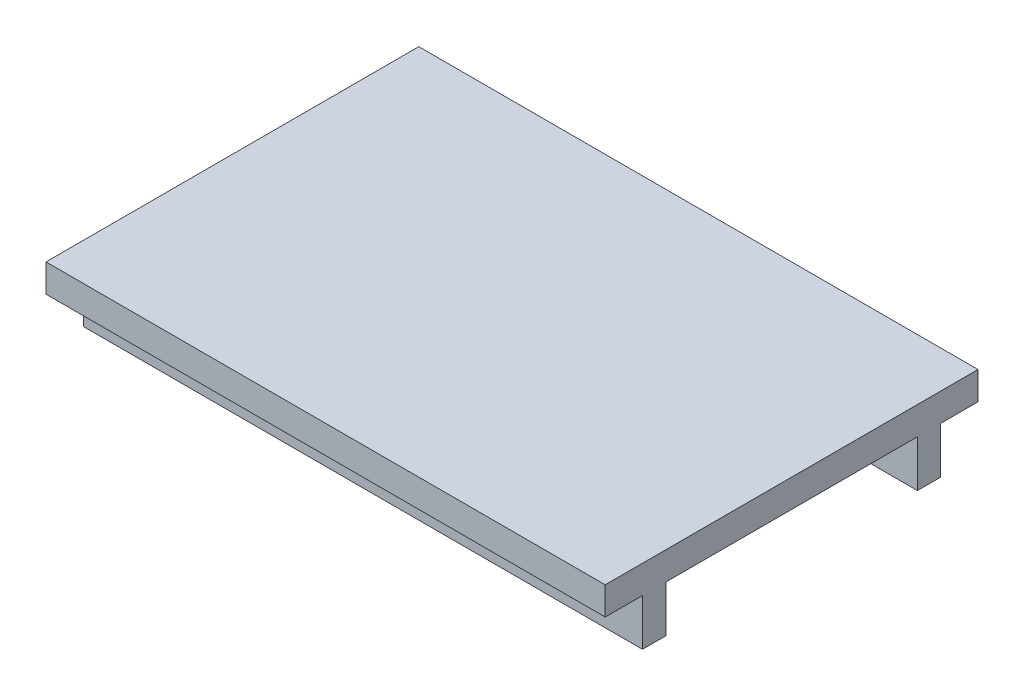
ISO-10303-21;
HEADER;
FILE_DESCRIPTION(('STEP AP214'),'2;1');
FILE_NAME('part.step','',(''),(''),'','','');
FILE_SCHEMA(('AUTOMOTIVE_DESIGN { 1 0 10303 214 1 1 1 1 }'));
ENDSEC;
DATA;
#1=APPLICATION_CONTEXT('core data for automotive mechanical design processes');
#2=APPLICATION_PROTOCOL_DEFINITION('international standard','automotive_design',2000,#1);
#3=PRODUCT_CONTEXT('',#1,'mechanical');
#4=PRODUCT('Part','Part','',(#3));
#5=PRODUCT_RELATED_PRODUCT_CATEGORY('part','',(#4));
#6=PRODUCT_DEFINITION_FORMATION('','',#4);
#7=PRODUCT_DEFINITION_CONTEXT('part definition',#1,'design');
#8=PRODUCT_DEFINITION('design','',#6,#7);
#9=PRODUCT_DEFINITION_SHAPE('','',#8);
#10=(LENGTH_UNIT() NAMED_UNIT(*) SI_UNIT(.MILLI.,.METRE.));
#11=(NAMED_UNIT(*) PLANE_ANGLE_UNIT() SI_UNIT($,.RADIAN.));
#12=(NAMED_UNIT(*) SI_UNIT($,.STERADIAN.) SOLID_ANGLE_UNIT());
#13=UNCERTAINTY_MEASURE_WITH_UNIT(LENGTH_MEASURE(1.E-05),#10,'distance_accuracy_value','');
#14=(GEOMETRIC_REPRESENTATION_CONTEXT(3) GLOBAL_UNCERTAINTY_ASSIGNED_CONTEXT((#13)) GLOBAL_UNIT_ASSIGNED_CONTEXT((#10,
#11,#12)) REPRESENTATION_CONTEXT('',''));
#15=CARTESIAN_POINT('',(0.,0.,0.));
#16=DIRECTION('',(0.,0.,1.));
#17=DIRECTION('',(1.,0.,0.));
#18=AXIS2_PLACEMENT_3D('',#15,#16,#17);
#19=CARTESIAN_POINT('',(-60.,-10.,-32.));
#20=DIRECTION('',(0.,0.,-1.));
#21=DIRECTION('',(-1.,0.,0.));
#22=AXIS2_PLACEMENT_3D('',#19,#20,#21);
#23=PLANE('',#22);
#24=DIRECTION('',(-1.,0.,0.));
#25=VECTOR('',#24,1.);
#26=CARTESIAN_POINT('',(-20.,-2.5,-32.));
#27=LINE('',#26,#25);
#28=CARTESIAN_POINT('',(50.,-2.5,-32.));
#29=VERTEX_POINT('',#28);
#30=CARTESIAN_POINT('',(-20.,-2.5,-32.));
#31=VERTEX_POINT('',#30);
#32=EDGE_CURVE('E196',#29,#31,#27,.T.);
#33=ORIENTED_EDGE('',*,*,#32,.T.);
#34=CARTESIAN_POINT('',(-20.,-5.,-32.));
#35=DIRECTION('',(0.,0.,1.));
#36=DIRECTION('',(1.,0.,0.));
#37=AXIS2_PLACEMENT_3D('',#34,#35,#36);
#38=CIRCLE('',#37,2.5);
#39=CARTESIAN_POINT('',(-20.,-7.5,-32.));
#40=VERTEX_POINT('',#39);
#41=EDGE_CURVE('E52',#31,#40,#38,.T.);
#42=ORIENTED_EDGE('',*,*,#41,.T.);
#43=DIRECTION('',(1.,0.,0.));
#44=VECTOR('',#43,1.);
#45=CARTESIAN_POINT('',(-20.,-7.5,-32.));
#46=LINE('',#45,#44);
#47=CARTESIAN_POINT('',(50.,-7.5,-32.));
#48=VERTEX_POINT('',#47);
#49=EDGE_CURVE('E182',#40,#48,#46,.T.);
#50=ORIENTED_EDGE('',*,*,#49,.T.);
#51=CARTESIAN_POINT('',(50.,-5.,-32.));
#52=DIRECTION('',(0.,0.,1.));
#53=DIRECTION('',(1.,0.,0.));
#54=AXIS2_PLACEMENT_3D('',#51,#52,#53);
#55=CIRCLE('',#54,2.5);
#56=EDGE_CURVE('E202',#48,#29,#55,.T.);
#57=ORIENTED_EDGE('',*,*,#56,.T.);
#58=EDGE_LOOP('',(#33,#42,#50,#57));
#59=FACE_BOUND('',#58,.T.);
#60=DIRECTION('',(-1.,0.,0.));
#61=VECTOR('',#60,1.);
#62=CARTESIAN_POINT('',(-60.,0.,-32.));
#63=LINE('',#62,#61);
#64=CARTESIAN_POINT('',(60.,0.,-32.));
#65=VERTEX_POINT('',#64);
#66=CARTESIAN_POINT('',(-60.,0.,-32.));
#67=VERTEX_POINT('',#66);
#68=EDGE_CURVE('E225',#65,#67,#63,.T.);
#69=ORIENTED_EDGE('',*,*,#68,.F.);
#70=DIRECTION('',(0.,1.,0.));
#71=VECTOR('',#70,1.);
#72=CARTESIAN_POINT('',(60.,-10.,-32.));
#73=LINE('',#72,#71);
#74=CARTESIAN_POINT('',(60.,-10.,-32.));
#75=VERTEX_POINT('',#74);
#76=EDGE_CURVE('E234',#75,#65,#73,.T.);
#77=ORIENTED_EDGE('',*,*,#76,.F.);
#78=DIRECTION('',(-1.,0.,0.));
#79=VECTOR('',#78,1.);
#80=CARTESIAN_POINT('',(-60.,-10.,-32.));
#81=LINE('',#80,#79);
#82=CARTESIAN_POINT('',(-60.,-10.,-32.));
#83=VERTEX_POINT('',#82);
#84=EDGE_CURVE('E214',#75,#83,#81,.T.);
#85=ORIENTED_EDGE('',*,*,#84,.T.);
#86=DIRECTION('',(0.,1.,0.));
#87=VECTOR('',#86,1.);
#88=CARTESIAN_POINT('',(-60.,-10.,-32.));
#89=LINE('',#88,#87);
#90=EDGE_CURVE('E237',#83,#67,#89,.T.);
#91=ORIENTED_EDGE('',*,*,#90,.T.);
#92=EDGE_LOOP('',(#69,#77,#85,#91));
#93=FACE_BOUND('',#92,.T.);
#94=CARTESIAN_POINT('',(-45.,-5.,-32.));
#95=DIRECTION('',(0.,0.,1.));
#96=DIRECTION('',(1.,0.,0.));
#97=AXIS2_PLACEMENT_3D('',#94,#95,#96);
#98=CIRCLE('',#97,2.5);
#99=CARTESIAN_POINT('',(-42.5,-5.,-32.));
#100=VERTEX_POINT('',#99);
#101=EDGE_CURVE('E188',#100,#100,#98,.T.);
#102=ORIENTED_EDGE('',*,*,#101,.T.);
#103=EDGE_LOOP('',(#102));
#104=FACE_BOUND('',#103,.T.);
#105=ADVANCED_FACE('F37',(#59,#93,#104),#23,.T.);
#106=CARTESIAN_POINT('',(-60.,-10.,-27.));
#107=DIRECTION('',(0.,0.,1.));
#108=DIRECTION('',(1.,0.,0.));
#109=AXIS2_PLACEMENT_3D('',#106,#107,#108);
#110=PLANE('',#109);
#111=DIRECTION('',(1.,0.,0.));
#112=VECTOR('',#111,1.);
#113=CARTESIAN_POINT('',(-20.,-7.5,-27.));
#114=LINE('',#113,#112);
#115=CARTESIAN_POINT('',(-20.,-7.5,-27.));
#116=VERTEX_POINT('',#115);
#117=CARTESIAN_POINT('',(50.,-7.5,-27.));
#118=VERTEX_POINT('',#117);
#119=EDGE_CURVE('E194',#116,#118,#114,.T.);
#120=ORIENTED_EDGE('',*,*,#119,.F.);
#121=CARTESIAN_POINT('',(-20.,-5.,-27.));
#122=DIRECTION('',(0.,0.,1.));
#123=DIRECTION('',(1.,0.,0.));
#124=AXIS2_PLACEMENT_3D('',#121,#122,#123);
#125=CIRCLE('',#124,2.5);
#126=CARTESIAN_POINT('',(-20.,-2.5,-27.));
#127=VERTEX_POINT('',#126);
#128=EDGE_CURVE('E176',#127,#116,#125,.T.);
#129=ORIENTED_EDGE('',*,*,#128,.F.);
#130=DIRECTION('',(-1.,0.,0.));
#131=VECTOR('',#130,1.);
#132=CARTESIAN_POINT('',(-20.,-2.5,-27.));
#133=LINE('',#132,#131);
#134=CARTESIAN_POINT('',(50.,-2.5,-27.));
#135=VERTEX_POINT('',#134);
#136=EDGE_CURVE('E185',#135,#127,#133,.T.);
#137=ORIENTED_EDGE('',*,*,#136,.F.);
#138=CARTESIAN_POINT('',(50.,-5.,-27.));
#139=DIRECTION('',(0.,0.,1.));
#140=DIRECTION('',(1.,0.,0.));
#141=AXIS2_PLACEMENT_3D('',#138,#139,#140);
#142=CIRCLE('',#141,2.5);
#143=EDGE_CURVE('E60',#118,#135,#142,.T.);
#144=ORIENTED_EDGE('',*,*,#143,.F.);
#145=EDGE_LOOP('',(#120,#129,#137,#144));
#146=FACE_BOUND('',#145,.T.);
#147=DIRECTION('',(1.,0.,0.));
#148=VECTOR('',#147,1.);
#149=CARTESIAN_POINT('',(-60.,0.,-27.));
#150=LINE('',#149,#148);
#151=CARTESIAN_POINT('',(-60.,0.,-27.));
#152=VERTEX_POINT('',#151);
#153=CARTESIAN_POINT('',(60.,0.,-27.));
#154=VERTEX_POINT('',#153);
#155=EDGE_CURVE('E215',#152,#154,#150,.T.);
#156=ORIENTED_EDGE('',*,*,#155,.F.);
#157=DIRECTION('',(0.,1.,0.));
#158=VECTOR('',#157,1.);
#159=CARTESIAN_POINT('',(-60.,-10.,-27.));
#160=LINE('',#159,#158);
#161=CARTESIAN_POINT('',(-60.,-10.,-27.));
#162=VERTEX_POINT('',#161);
#163=EDGE_CURVE('E224',#162,#152,#160,.T.);
#164=ORIENTED_EDGE('',*,*,#163,.F.);
#165=DIRECTION('',(1.,0.,0.));
#166=VECTOR('',#165,1.);
#167=CARTESIAN_POINT('',(-60.,-10.,-27.));
#168=LINE('',#167,#166);
#169=CARTESIAN_POINT('',(60.,-10.,-27.));
#170=VERTEX_POINT('',#169);
#171=EDGE_CURVE('E221',#162,#170,#168,.T.);
#172=ORIENTED_EDGE('',*,*,#171,.T.);
#173=DIRECTION('',(0.,1.,0.));
#174=VECTOR('',#173,1.);
#175=CARTESIAN_POINT('',(60.,-10.,-27.));
#176=LINE('',#175,#174);
#177=EDGE_CURVE('E231',#170,#154,#176,.T.);
#178=ORIENTED_EDGE('',*,*,#177,.T.);
#179=EDGE_LOOP('',(#156,#164,#172,#178));
#180=FACE_BOUND('',#179,.T.);
#181=CARTESIAN_POINT('',(-45.,-5.,-27.));
#182=DIRECTION('',(0.,0.,1.));
#183=DIRECTION('',(1.,0.,0.));
#184=AXIS2_PLACEMENT_3D('',#181,#182,#183);
#185=CIRCLE('',#184,2.5);
#186=CARTESIAN_POINT('',(-42.5,-5.,-27.));
#187=VERTEX_POINT('',#186);
#188=EDGE_CURVE('E227',#187,#187,#185,.T.);
#189=ORIENTED_EDGE('',*,*,#188,.F.);
#190=EDGE_LOOP('',(#189));
#191=FACE_BOUND('',#190,.T.);
#192=ADVANCED_FACE('F191',(#146,#180,#191),#110,.T.);
#193=CARTESIAN_POINT('',(0.,0.,0.));
#194=DIRECTION('',(0.,-1.,0.));
#195=DIRECTION('',(0.,0.,-1.));
#196=AXIS2_PLACEMENT_3D('',#193,#194,#195);
#197=PLANE('',#196);
#198=ORIENTED_EDGE('',*,*,#68,.T.);
#199=DIRECTION('',(0.,0.,1.));
#200=VECTOR('',#199,1.);
#201=CARTESIAN_POINT('',(-60.,0.,40.));
#202=LINE('',#201,#200);
#203=CARTESIAN_POINT('',(-60.,0.,-40.));
#204=VERTEX_POINT('',#203);
#205=EDGE_CURVE('E323',#204,#67,#202,.T.);
#206=ORIENTED_EDGE('',*,*,#205,.F.);
#207=DIRECTION('',(-1.,0.,0.));
#208=VECTOR('',#207,1.);
#209=CARTESIAN_POINT('',(-60.,0.,-40.));
#210=LINE('',#209,#208);
#211=CARTESIAN_POINT('',(60.,0.,-40.));
#212=VERTEX_POINT('',#211);
#213=EDGE_CURVE('E319',#212,#204,#210,.T.);
#214=ORIENTED_EDGE('',*,*,#213,.F.);
#215=DIRECTION('',(0.,0.,-1.));
#216=VECTOR('',#215,1.);
#217=CARTESIAN_POINT('',(60.,0.,40.));
#218=LINE('',#217,#216);
#219=EDGE_CURVE('E304',#65,#212,#218,.T.);
#220=ORIENTED_EDGE('',*,*,#219,.F.);
#221=EDGE_LOOP('',(#198,#206,#214,#220));
#222=FACE_BOUND('',#221,.T.);
#223=ADVANCED_FACE('F342',(#222),#197,.T.);
#224=DIRECTION('',(-1.,0.,0.));
#225=VECTOR('',#224,1.);
#226=CARTESIAN_POINT('',(-60.,0.,32.));
#227=LINE('',#226,#225);
#228=CARTESIAN_POINT('',(60.,0.,32.));
#229=VERTEX_POINT('',#228);
#230=CARTESIAN_POINT('',(-60.,0.,32.));
#231=VERTEX_POINT('',#230);
#232=EDGE_CURVE('E282',#229,#231,#227,.T.);
#233=ORIENTED_EDGE('',*,*,#232,.F.);
#234=CARTESIAN_POINT('',(60.,0.,40.));
#235=VERTEX_POINT('',#234);
#236=EDGE_CURVE('E316',#235,#229,#218,.T.);
#237=ORIENTED_EDGE('',*,*,#236,.F.);
#238=DIRECTION('',(1.,0.,0.));
#239=VECTOR('',#238,1.);
#240=CARTESIAN_POINT('',(-60.,0.,40.));
#241=LINE('',#240,#239);
#242=CARTESIAN_POINT('',(-60.,0.,40.));
#243=VERTEX_POINT('',#242);
#244=EDGE_CURVE('E309',#243,#235,#241,.T.);
#245=ORIENTED_EDGE('',*,*,#244,.F.);
#246=EDGE_CURVE('E322',#231,#243,#202,.T.);
#247=ORIENTED_EDGE('',*,*,#246,.F.);
#248=EDGE_LOOP('',(#233,#237,#245,#247));
#249=FACE_BOUND('',#248,.T.);
#250=ADVANCED_FACE('F373',(#249),#197,.T.);
#251=CARTESIAN_POINT('',(60.,6.,40.));
#252=DIRECTION('',(-1.,0.,0.));
#253=DIRECTION('',(0.,0.,1.));
#254=AXIS2_PLACEMENT_3D('',#251,#252,#253);
#255=PLANE('',#254);
#256=ORIENTED_EDGE('',*,*,#236,.T.);
#257=DIRECTION('',(0.,1.,0.));
#258=VECTOR('',#257,1.);
#259=CARTESIAN_POINT('',(60.,-10.,32.));
#260=LINE('',#259,#258);
#261=CARTESIAN_POINT('',(60.,-10.,32.));
#262=VERTEX_POINT('',#261);
#263=EDGE_CURVE('E295',#262,#229,#260,.T.);
#264=ORIENTED_EDGE('',*,*,#263,.F.);
#265=DIRECTION('',(0.,0.,1.));
#266=VECTOR('',#265,1.);
#267=CARTESIAN_POINT('',(60.,-10.,32.));
#268=LINE('',#267,#266);
#269=CARTESIAN_POINT('',(60.,-10.,27.));
#270=VERTEX_POINT('',#269);
#271=EDGE_CURVE('E284',#270,#262,#268,.T.);
#272=ORIENTED_EDGE('',*,*,#271,.F.);
#273=DIRECTION('',(0.,1.,0.));
#274=VECTOR('',#273,1.);
#275=CARTESIAN_POINT('',(60.,-10.,27.));
#276=LINE('',#275,#274);
#277=CARTESIAN_POINT('',(60.,0.,27.));
#278=VERTEX_POINT('',#277);
#279=EDGE_CURVE('E298',#270,#278,#276,.T.);
#280=ORIENTED_EDGE('',*,*,#279,.T.);
#281=EDGE_CURVE('E320',#278,#154,#218,.T.);
#282=ORIENTED_EDGE('',*,*,#281,.T.);
#283=ORIENTED_EDGE('',*,*,#177,.F.);
#284=DIRECTION('',(0.,0.,-1.));
#285=VECTOR('',#284,1.);
#286=CARTESIAN_POINT('',(60.,-10.,-32.));
#287=LINE('',#286,#285);
#288=EDGE_CURVE('E218',#170,#75,#287,.T.);
#289=ORIENTED_EDGE('',*,*,#288,.T.);
#290=ORIENTED_EDGE('',*,*,#76,.T.);
#291=ORIENTED_EDGE('',*,*,#219,.T.);
#292=DIRECTION('',(0.,-1.,0.));
#293=VECTOR('',#292,1.);
#294=CARTESIAN_POINT('',(60.,6.,-40.));
#295=LINE('',#294,#293);
#296=CARTESIAN_POINT('',(60.,6.,-40.));
#297=VERTEX_POINT('',#296);
#298=EDGE_CURVE('E11',#297,#212,#295,.T.);
#299=ORIENTED_EDGE('',*,*,#298,.F.);
#300=DIRECTION('',(0.,0.,-1.));
#301=VECTOR('',#300,1.);
#302=CARTESIAN_POINT('',(60.,6.,40.));
#303=LINE('',#302,#301);
#304=CARTESIAN_POINT('',(60.,6.,40.));
#305=VERTEX_POINT('',#304);
#306=EDGE_CURVE('E305',#305,#297,#303,.T.);
#307=ORIENTED_EDGE('',*,*,#306,.F.);
#308=DIRECTION('',(0.,-1.,0.));
#309=VECTOR('',#308,1.);
#310=CARTESIAN_POINT('',(60.,6.,40.));
#311=LINE('',#310,#309);
#312=EDGE_CURVE('E315',#305,#235,#311,.T.);
#313=ORIENTED_EDGE('',*,*,#312,.T.);
#314=EDGE_LOOP('',(#256,#264,#272,#280,#282,#283,#289,#290,#291,#299,#307,#313));
#315=FACE_BOUND('',#314,.T.);
#316=ADVANCED_FACE('F39',(#315),#255,.F.);
#317=CARTESIAN_POINT('',(-60.,6.,-40.));
#318=DIRECTION('',(0.,0.,1.));
#319=DIRECTION('',(1.,0.,0.));
#320=AXIS2_PLACEMENT_3D('',#317,#318,#319);
#321=PLANE('',#320);
#322=ORIENTED_EDGE('',*,*,#213,.T.);
#323=DIRECTION('',(0.,-1.,0.));
#324=VECTOR('',#323,1.);
#325=CARTESIAN_POINT('',(-60.,6.,-40.));
#326=LINE('',#325,#324);
#327=CARTESIAN_POINT('',(-60.,6.,-40.));
#328=VERTEX_POINT('',#327);
#329=EDGE_CURVE('E45',#328,#204,#326,.T.);
#330=ORIENTED_EDGE('',*,*,#329,.F.);
#331=DIRECTION('',(-1.,0.,0.));
#332=VECTOR('',#331,1.);
#333=CARTESIAN_POINT('',(-60.,6.,-40.));
#334=LINE('',#333,#332);
#335=EDGE_CURVE('E308',#297,#328,#334,.T.);
#336=ORIENTED_EDGE('',*,*,#335,.F.);
#337=ORIENTED_EDGE('',*,*,#298,.T.);
#338=EDGE_LOOP('',(#322,#330,#336,#337));
#339=FACE_BOUND('',#338,.T.);
#340=ADVANCED_FACE('F384',(#339),#321,.F.);
#341=CARTESIAN_POINT('',(-60.,6.,40.));
#342=DIRECTION('',(1.,0.,0.));
#343=DIRECTION('',(0.,0.,-1.));
#344=AXIS2_PLACEMENT_3D('',#341,#342,#343);
#345=PLANE('',#344);
#346=ORIENTED_EDGE('',*,*,#205,.T.);
#347=ORIENTED_EDGE('',*,*,#90,.F.);
#348=DIRECTION('',(0.,0.,1.));
#349=VECTOR('',#348,1.);
#350=CARTESIAN_POINT('',(-60.,-10.,-32.));
#351=LINE('',#350,#349);
#352=EDGE_CURVE('E211',#83,#162,#351,.T.);
#353=ORIENTED_EDGE('',*,*,#352,.T.);
#354=ORIENTED_EDGE('',*,*,#163,.T.);
#355=CARTESIAN_POINT('',(-60.,0.,27.));
#356=VERTEX_POINT('',#355);
#357=EDGE_CURVE('E326',#152,#356,#202,.T.);
#358=ORIENTED_EDGE('',*,*,#357,.T.);
#359=DIRECTION('',(0.,1.,0.));
#360=VECTOR('',#359,1.);
#361=CARTESIAN_POINT('',(-60.,-10.,27.));
#362=LINE('',#361,#360);
#363=CARTESIAN_POINT('',(-60.,-10.,27.));
#364=VERTEX_POINT('',#363);
#365=EDGE_CURVE('E301',#364,#356,#362,.T.);
#366=ORIENTED_EDGE('',*,*,#365,.F.);
#367=DIRECTION('',(0.,0.,-1.));
#368=VECTOR('',#367,1.);
#369=CARTESIAN_POINT('',(-60.,-10.,32.));
#370=LINE('',#369,#368);
#371=CARTESIAN_POINT('',(-60.,-10.,32.));
#372=VERTEX_POINT('',#371);
#373=EDGE_CURVE('E278',#372,#364,#370,.T.);
#374=ORIENTED_EDGE('',*,*,#373,.F.);
#375=DIRECTION('',(0.,1.,0.));
#376=VECTOR('',#375,1.);
#377=CARTESIAN_POINT('',(-60.,-10.,32.));
#378=LINE('',#377,#376);
#379=EDGE_CURVE('E288',#372,#231,#378,.T.);
#380=ORIENTED_EDGE('',*,*,#379,.T.);
#381=ORIENTED_EDGE('',*,*,#246,.T.);
#382=DIRECTION('',(0.,-1.,0.));
#383=VECTOR('',#382,1.);
#384=CARTESIAN_POINT('',(-60.,6.,40.));
#385=LINE('',#384,#383);
#386=CARTESIAN_POINT('',(-60.,6.,40.));
#387=VERTEX_POINT('',#386);
#388=EDGE_CURVE('E330',#387,#243,#385,.T.);
#389=ORIENTED_EDGE('',*,*,#388,.F.);
#390=DIRECTION('',(0.,0.,1.));
#391=VECTOR('',#390,1.);
#392=CARTESIAN_POINT('',(-60.,6.,40.));
#393=LINE('',#392,#391);
#394=EDGE_CURVE('E311',#328,#387,#393,.T.);
#395=ORIENTED_EDGE('',*,*,#394,.F.);
#396=ORIENTED_EDGE('',*,*,#329,.T.);
#397=EDGE_LOOP('',(#346,#347,#353,#354,#358,#366,#374,#380,#381,#389,#395,#396));
#398=FACE_BOUND('',#397,.T.);
#399=ADVANCED_FACE('F337',(#398),#345,.F.);
#400=CARTESIAN_POINT('',(-60.,6.,40.));
#401=DIRECTION('',(0.,0.,-1.));
#402=DIRECTION('',(-1.,0.,0.));
#403=AXIS2_PLACEMENT_3D('',#400,#401,#402);
#404=PLANE('',#403);
#405=ORIENTED_EDGE('',*,*,#244,.T.);
#406=ORIENTED_EDGE('',*,*,#312,.F.);
#407=DIRECTION('',(1.,0.,0.));
#408=VECTOR('',#407,1.);
#409=CARTESIAN_POINT('',(-60.,6.,40.));
#410=LINE('',#409,#408);
#411=EDGE_CURVE('E313',#387,#305,#410,.T.);
#412=ORIENTED_EDGE('',*,*,#411,.F.);
#413=ORIENTED_EDGE('',*,*,#388,.T.);
#414=EDGE_LOOP('',(#405,#406,#412,#413));
#415=FACE_BOUND('',#414,.T.);
#416=ADVANCED_FACE('F381',(#415),#404,.F.);
#417=CARTESIAN_POINT('',(0.,6.,0.));
#418=DIRECTION('',(0.,-1.,0.));
#419=DIRECTION('',(0.,0.,-1.));
#420=AXIS2_PLACEMENT_3D('',#417,#418,#419);
#421=PLANE('',#420);
#422=ORIENTED_EDGE('',*,*,#306,.T.);
#423=ORIENTED_EDGE('',*,*,#335,.T.);
#424=ORIENTED_EDGE('',*,*,#394,.T.);
#425=ORIENTED_EDGE('',*,*,#411,.T.);
#426=EDGE_LOOP('',(#422,#423,#424,#425));
#427=FACE_BOUND('',#426,.T.);
#428=ADVANCED_FACE('F383',(#427),#421,.F.);
#429=ORIENTED_EDGE('',*,*,#155,.T.);
#430=ORIENTED_EDGE('',*,*,#281,.F.);
#431=DIRECTION('',(1.,0.,0.));
#432=VECTOR('',#431,1.);
#433=CARTESIAN_POINT('',(-60.,0.,27.));
#434=LINE('',#433,#432);
#435=EDGE_CURVE('E248',#356,#278,#434,.T.);
#436=ORIENTED_EDGE('',*,*,#435,.F.);
#437=ORIENTED_EDGE('',*,*,#357,.F.);
#438=EDGE_LOOP('',(#429,#430,#436,#437));
#439=FACE_BOUND('',#438,.T.);
#440=ADVANCED_FACE('F358',(#439),#197,.T.);
#441=CARTESIAN_POINT('',(-60.,-10.,27.));
#442=DIRECTION('',(0.,0.,1.));
#443=DIRECTION('',(1.,0.,0.));
#444=AXIS2_PLACEMENT_3D('',#441,#442,#443);
#445=PLANE('',#444);
#446=CARTESIAN_POINT('',(-45.,-5.,27.));
#447=DIRECTION('',(0.,0.,1.));
#448=DIRECTION('',(1.,0.,0.));
#449=AXIS2_PLACEMENT_3D('',#446,#447,#448);
#450=CIRCLE('',#449,2.5);
#451=CARTESIAN_POINT('',(-42.5,-5.,27.));
#452=VERTEX_POINT('',#451);
#453=EDGE_CURVE('E244',#452,#452,#450,.F.);
#454=ORIENTED_EDGE('',*,*,#453,.F.);
#455=EDGE_LOOP('',(#454));
#456=FACE_BOUND('',#455,.T.);
#457=DIRECTION('',(1.,0.,0.));
#458=VECTOR('',#457,1.);
#459=CARTESIAN_POINT('',(-20.,-2.5,27.));
#460=LINE('',#459,#458);
#461=CARTESIAN_POINT('',(-20.,-2.5,27.));
#462=VERTEX_POINT('',#461);
#463=CARTESIAN_POINT('',(50.,-2.5,27.));
#464=VERTEX_POINT('',#463);
#465=EDGE_CURVE('E250',#462,#464,#460,.T.);
#466=ORIENTED_EDGE('',*,*,#465,.F.);
#467=CARTESIAN_POINT('',(-20.,-5.,27.));
#468=DIRECTION('',(0.,0.,1.));
#469=DIRECTION('',(1.,0.,0.));
#470=AXIS2_PLACEMENT_3D('',#467,#468,#469);
#471=CIRCLE('',#470,2.5);
#472=CARTESIAN_POINT('',(-20.,-7.5,27.));
#473=VERTEX_POINT('',#472);
#474=EDGE_CURVE('E253',#473,#462,#471,.F.);
#475=ORIENTED_EDGE('',*,*,#474,.F.);
#476=DIRECTION('',(-1.,0.,0.));
#477=VECTOR('',#476,1.);
#478=CARTESIAN_POINT('',(-20.,-7.5,27.));
#479=LINE('',#478,#477);
#480=CARTESIAN_POINT('',(50.,-7.5,27.));
#481=VERTEX_POINT('',#480);
#482=EDGE_CURVE('E245',#481,#473,#479,.T.);
#483=ORIENTED_EDGE('',*,*,#482,.F.);
#484=CARTESIAN_POINT('',(50.,-5.,27.));
#485=DIRECTION('',(0.,0.,1.));
#486=DIRECTION('',(1.,0.,0.));
#487=AXIS2_PLACEMENT_3D('',#484,#485,#486);
#488=CIRCLE('',#487,2.5);
#489=EDGE_CURVE('E240',#464,#481,#488,.F.);
#490=ORIENTED_EDGE('',*,*,#489,.F.);
#491=EDGE_LOOP('',(#466,#475,#483,#490));
#492=FACE_BOUND('',#491,.T.);
#493=ORIENTED_EDGE('',*,*,#435,.T.);
#494=ORIENTED_EDGE('',*,*,#279,.F.);
#495=DIRECTION('',(1.,0.,0.));
#496=VECTOR('',#495,1.);
#497=CARTESIAN_POINT('',(-60.,-10.,27.));
#498=LINE('',#497,#496);
#499=EDGE_CURVE('E281',#364,#270,#498,.T.);
#500=ORIENTED_EDGE('',*,*,#499,.F.);
#501=ORIENTED_EDGE('',*,*,#365,.T.);
#502=EDGE_LOOP('',(#493,#494,#500,#501));
#503=FACE_BOUND('',#502,.T.);
#504=ADVANCED_FACE('F362',(#456,#492,#503),#445,.F.);
#505=CARTESIAN_POINT('',(-60.,-10.,32.));
#506=DIRECTION('',(0.,0.,-1.));
#507=DIRECTION('',(-1.,0.,0.));
#508=AXIS2_PLACEMENT_3D('',#505,#506,#507);
#509=PLANE('',#508);
#510=CARTESIAN_POINT('',(-45.,-5.,32.));
#511=DIRECTION('',(0.,0.,1.));
#512=DIRECTION('',(1.,0.,0.));
#513=AXIS2_PLACEMENT_3D('',#510,#511,#512);
#514=CIRCLE('',#513,2.5);
#515=CARTESIAN_POINT('',(-42.5,-5.,32.));
#516=VERTEX_POINT('',#515);
#517=EDGE_CURVE('E241',#516,#516,#514,.T.);
#518=ORIENTED_EDGE('',*,*,#517,.F.);
#519=EDGE_LOOP('',(#518));
#520=FACE_BOUND('',#519,.T.);
#521=DIRECTION('',(1.,0.,0.));
#522=VECTOR('',#521,1.);
#523=CARTESIAN_POINT('',(-20.,-7.5,32.));
#524=LINE('',#523,#522);
#525=CARTESIAN_POINT('',(-20.,-7.5,32.));
#526=VERTEX_POINT('',#525);
#527=CARTESIAN_POINT('',(50.,-7.5,32.));
#528=VERTEX_POINT('',#527);
#529=EDGE_CURVE('E258',#526,#528,#524,.T.);
#530=ORIENTED_EDGE('',*,*,#529,.F.);
#531=CARTESIAN_POINT('',(-20.,-5.,32.));
#532=DIRECTION('',(0.,0.,1.));
#533=DIRECTION('',(1.,0.,0.));
#534=AXIS2_PLACEMENT_3D('',#531,#532,#533);
#535=CIRCLE('',#534,2.5);
#536=CARTESIAN_POINT('',(-20.,-2.5,32.));
#537=VERTEX_POINT('',#536);
#538=EDGE_CURVE('E256',#537,#526,#535,.T.);
#539=ORIENTED_EDGE('',*,*,#538,.F.);
#540=DIRECTION('',(-1.,0.,0.));
#541=VECTOR('',#540,1.);
#542=CARTESIAN_POINT('',(-20.,-2.5,32.));
#543=LINE('',#542,#541);
#544=CARTESIAN_POINT('',(50.,-2.5,32.));
#545=VERTEX_POINT('',#544);
#546=EDGE_CURVE('E264',#545,#537,#543,.T.);
#547=ORIENTED_EDGE('',*,*,#546,.F.);
#548=CARTESIAN_POINT('',(50.,-5.,32.));
#549=DIRECTION('',(0.,0.,1.));
#550=DIRECTION('',(1.,0.,0.));
#551=AXIS2_PLACEMENT_3D('',#548,#549,#550);
#552=CIRCLE('',#551,2.5);
#553=EDGE_CURVE('E261',#528,#545,#552,.T.);
#554=ORIENTED_EDGE('',*,*,#553,.F.);
#555=EDGE_LOOP('',(#530,#539,#547,#554));
#556=FACE_BOUND('',#555,.T.);
#557=ORIENTED_EDGE('',*,*,#232,.T.);
#558=ORIENTED_EDGE('',*,*,#379,.F.);
#559=DIRECTION('',(-1.,0.,0.));
#560=VECTOR('',#559,1.);
#561=CARTESIAN_POINT('',(-60.,-10.,32.));
#562=LINE('',#561,#560);
#563=EDGE_CURVE('E286',#262,#372,#562,.T.);
#564=ORIENTED_EDGE('',*,*,#563,.F.);
#565=ORIENTED_EDGE('',*,*,#263,.T.);
#566=EDGE_LOOP('',(#557,#558,#564,#565));
#567=FACE_BOUND('',#566,.T.);
#568=ADVANCED_FACE('F369',(#520,#556,#567),#509,.F.);
#569=CARTESIAN_POINT('',(0.,-10.,0.));
#570=DIRECTION('',(0.,-1.,0.));
#571=DIRECTION('',(0.,0.,-1.));
#572=AXIS2_PLACEMENT_3D('',#569,#570,#571);
#573=PLANE('',#572);
#574=ORIENTED_EDGE('',*,*,#373,.T.);
#575=ORIENTED_EDGE('',*,*,#499,.T.);
#576=ORIENTED_EDGE('',*,*,#271,.T.);
#577=ORIENTED_EDGE('',*,*,#563,.T.);
#578=EDGE_LOOP('',(#574,#575,#576,#577));
#579=FACE_BOUND('',#578,.T.);
#580=ADVANCED_FACE('F365',(#579),#573,.T.);
#581=CARTESIAN_POINT('',(-20.,-5.,-40.001));
#582=DIRECTION('',(0.,0.,1.));
#583=DIRECTION('',(1.,0.,0.));
#584=AXIS2_PLACEMENT_3D('',#581,#582,#583);
#585=CYLINDRICAL_SURFACE('',#584,2.5);
#586=ORIENTED_EDGE('',*,*,#474,.T.);
#587=DIRECTION('',(0.,0.,1.));
#588=VECTOR('',#587,1.);
#589=CARTESIAN_POINT('',(-20.,-2.5,-40.001));
#590=LINE('',#589,#588);
#591=EDGE_CURVE('E268',#462,#537,#590,.T.);
#592=ORIENTED_EDGE('',*,*,#591,.T.);
#593=ORIENTED_EDGE('',*,*,#538,.T.);
#594=DIRECTION('',(0.,0.,1.));
#595=VECTOR('',#594,1.);
#596=CARTESIAN_POINT('',(-20.,-7.5,-40.001));
#597=LINE('',#596,#595);
#598=EDGE_CURVE('E267',#473,#526,#597,.T.);
#599=ORIENTED_EDGE('',*,*,#598,.F.);
#600=EDGE_LOOP('',(#586,#592,#593,#599));
#601=FACE_BOUND('',#600,.T.);
#602=ADVANCED_FACE('F409',(#601),#585,.F.);
#603=CARTESIAN_POINT('',(-20.,-2.5,-40.001));
#604=DIRECTION('',(0.,1.,0.));
#605=DIRECTION('',(0.,0.,1.));
#606=AXIS2_PLACEMENT_3D('',#603,#604,#605);
#607=PLANE('',#606);
#608=ORIENTED_EDGE('',*,*,#465,.T.);
#609=DIRECTION('',(0.,0.,1.));
#610=VECTOR('',#609,1.);
#611=CARTESIAN_POINT('',(50.,-2.5,-40.001));
#612=LINE('',#611,#610);
#613=EDGE_CURVE('E270',#464,#545,#612,.T.);
#614=ORIENTED_EDGE('',*,*,#613,.T.);
#615=ORIENTED_EDGE('',*,*,#546,.T.);
#616=ORIENTED_EDGE('',*,*,#591,.F.);
#617=EDGE_LOOP('',(#608,#614,#615,#616));
#618=FACE_BOUND('',#617,.T.);
#619=ADVANCED_FACE('F405',(#618),#607,.F.);
#620=CARTESIAN_POINT('',(50.,-5.,-40.001));
#621=DIRECTION('',(0.,0.,1.));
#622=DIRECTION('',(1.,0.,0.));
#623=AXIS2_PLACEMENT_3D('',#620,#621,#622);
#624=CYLINDRICAL_SURFACE('',#623,2.5);
#625=ORIENTED_EDGE('',*,*,#489,.T.);
#626=DIRECTION('',(0.,0.,1.));
#627=VECTOR('',#626,1.);
#628=CARTESIAN_POINT('',(50.,-7.5,-40.001));
#629=LINE('',#628,#627);
#630=EDGE_CURVE('E272',#481,#528,#629,.T.);
#631=ORIENTED_EDGE('',*,*,#630,.T.);
#632=ORIENTED_EDGE('',*,*,#553,.T.);
#633=ORIENTED_EDGE('',*,*,#613,.F.);
#634=EDGE_LOOP('',(#625,#631,#632,#633));
#635=FACE_BOUND('',#634,.T.);
#636=ADVANCED_FACE('F408',(#635),#624,.F.);
#637=CARTESIAN_POINT('',(-20.,-7.5,-40.001));
#638=DIRECTION('',(0.,-1.,0.));
#639=DIRECTION('',(0.,0.,-1.));
#640=AXIS2_PLACEMENT_3D('',#637,#638,#639);
#641=PLANE('',#640);
#642=ORIENTED_EDGE('',*,*,#482,.T.);
#643=ORIENTED_EDGE('',*,*,#598,.T.);
#644=ORIENTED_EDGE('',*,*,#529,.T.);
#645=ORIENTED_EDGE('',*,*,#630,.F.);
#646=EDGE_LOOP('',(#642,#643,#644,#645));
#647=FACE_BOUND('',#646,.T.);
#648=ADVANCED_FACE('F403',(#647),#641,.F.);
#649=CARTESIAN_POINT('',(-45.,-5.,-40.001));
#650=DIRECTION('',(0.,0.,1.));
#651=DIRECTION('',(1.,0.,0.));
#652=AXIS2_PLACEMENT_3D('',#649,#650,#651);
#653=CYLINDRICAL_SURFACE('',#652,2.5);
#654=ORIENTED_EDGE('',*,*,#517,.T.);
#655=EDGE_LOOP('',(#654));
#656=FACE_BOUND('',#655,.T.);
#657=ORIENTED_EDGE('',*,*,#453,.T.);
#658=EDGE_LOOP('',(#657));
#659=FACE_BOUND('',#658,.T.);
#660=ADVANCED_FACE('F400',(#656,#659),#653,.F.);
#661=CARTESIAN_POINT('',(0.,-10.,0.));
#662=DIRECTION('',(0.,-1.,0.));
#663=DIRECTION('',(0.,0.,1.));
#664=AXIS2_PLACEMENT_3D('',#661,#662,#663);
#665=PLANE('',#664);
#666=ORIENTED_EDGE('',*,*,#352,.F.);
#667=ORIENTED_EDGE('',*,*,#84,.F.);
#668=ORIENTED_EDGE('',*,*,#288,.F.);
#669=ORIENTED_EDGE('',*,*,#171,.F.);
#670=EDGE_LOOP('',(#666,#667,#668,#669));
#671=FACE_BOUND('',#670,.T.);
#672=ADVANCED_FACE('F350',(#671),#665,.T.);
#673=CARTESIAN_POINT('',(-20.,-5.,40.001));
#674=DIRECTION('',(0.,0.,-1.));
#675=DIRECTION('',(-1.,0.,0.));
#676=AXIS2_PLACEMENT_3D('',#673,#674,#675);
#677=CYLINDRICAL_SURFACE('',#676,2.5);
#678=ORIENTED_EDGE('',*,*,#128,.T.);
#679=DIRECTION('',(0.,0.,-1.));
#680=VECTOR('',#679,1.);
#681=CARTESIAN_POINT('',(-20.,-7.5,40.001));
#682=LINE('',#681,#680);
#683=EDGE_CURVE('E189',#116,#40,#682,.T.);
#684=ORIENTED_EDGE('',*,*,#683,.T.);
#685=ORIENTED_EDGE('',*,*,#41,.F.);
#686=DIRECTION('',(0.,0.,-1.));
#687=VECTOR('',#686,1.);
#688=CARTESIAN_POINT('',(-20.,-2.5,40.001));
#689=LINE('',#688,#687);
#690=EDGE_CURVE('E172',#127,#31,#689,.T.);
#691=ORIENTED_EDGE('',*,*,#690,.F.);
#692=EDGE_LOOP('',(#678,#684,#685,#691));
#693=FACE_BOUND('',#692,.T.);
#694=ADVANCED_FACE('F174',(#693),#677,.F.);
#695=CARTESIAN_POINT('',(-20.,-7.5,40.001));
#696=DIRECTION('',(0.,1.,0.));
#697=DIRECTION('',(0.,0.,1.));
#698=AXIS2_PLACEMENT_3D('',#695,#696,#697);
#699=PLANE('',#698);
#700=ORIENTED_EDGE('',*,*,#119,.T.);
#701=DIRECTION('',(0.,0.,-1.));
#702=VECTOR('',#701,1.);
#703=CARTESIAN_POINT('',(50.,-7.5,40.001));
#704=LINE('',#703,#702);
#705=EDGE_CURVE('E208',#118,#48,#704,.T.);
#706=ORIENTED_EDGE('',*,*,#705,.T.);
#707=ORIENTED_EDGE('',*,*,#49,.F.);
#708=ORIENTED_EDGE('',*,*,#683,.F.);
#709=EDGE_LOOP('',(#700,#706,#707,#708));
#710=FACE_BOUND('',#709,.T.);
#711=ADVANCED_FACE('F489',(#710),#699,.T.);
#712=CARTESIAN_POINT('',(50.,-5.,40.001));
#713=DIRECTION('',(0.,0.,-1.));
#714=DIRECTION('',(-1.,0.,0.));
#715=AXIS2_PLACEMENT_3D('',#712,#713,#714);
#716=CYLINDRICAL_SURFACE('',#715,2.5);
#717=ORIENTED_EDGE('',*,*,#143,.T.);
#718=DIRECTION('',(0.,0.,-1.));
#719=VECTOR('',#718,1.);
#720=CARTESIAN_POINT('',(50.,-2.5,40.001));
#721=LINE('',#720,#719);
#722=EDGE_CURVE('E181',#135,#29,#721,.T.);
#723=ORIENTED_EDGE('',*,*,#722,.T.);
#724=ORIENTED_EDGE('',*,*,#56,.F.);
#725=ORIENTED_EDGE('',*,*,#705,.F.);
#726=EDGE_LOOP('',(#717,#723,#724,#725));
#727=FACE_BOUND('',#726,.T.);
#728=ADVANCED_FACE('F496',(#727),#716,.F.);
#729=CARTESIAN_POINT('',(-20.,-2.5,40.001));
#730=DIRECTION('',(0.,-1.,0.));
#731=DIRECTION('',(0.,0.,-1.));
#732=AXIS2_PLACEMENT_3D('',#729,#730,#731);
#733=PLANE('',#732);
#734=ORIENTED_EDGE('',*,*,#136,.T.);
#735=ORIENTED_EDGE('',*,*,#690,.T.);
#736=ORIENTED_EDGE('',*,*,#32,.F.);
#737=ORIENTED_EDGE('',*,*,#722,.F.);
#738=EDGE_LOOP('',(#734,#735,#736,#737));
#739=FACE_BOUND('',#738,.T.);
#740=ADVANCED_FACE('F186',(#739),#733,.T.);
#741=CARTESIAN_POINT('',(-45.,-5.,40.001));
#742=DIRECTION('',(0.,0.,-1.));
#743=DIRECTION('',(-1.,0.,0.));
#744=AXIS2_PLACEMENT_3D('',#741,#742,#743);
#745=CYLINDRICAL_SURFACE('',#744,2.5);
#746=ORIENTED_EDGE('',*,*,#188,.T.);
#747=EDGE_LOOP('',(#746));
#748=FACE_BOUND('',#747,.T.);
#749=ORIENTED_EDGE('',*,*,#101,.F.);
#750=EDGE_LOOP('',(#749));
#751=FACE_BOUND('',#750,.T.);
#752=ADVANCED_FACE('F510',(#748,#751),#745,.F.);
#753=CLOSED_SHELL('',(#105,#192,#223,#250,#316,#340,#399,#416,#428,#440,#504,#568,#580,#602,
#619,#636,#648,#660,#672,#694,#711,#728,#740,#752));
#754=MANIFOLD_SOLID_BREP('B2',#753);
#755=ADVANCED_BREP_SHAPE_REPRESENTATION('',(#18,#754),#14);
#756=SHAPE_DEFINITION_REPRESENTATION(#9,#755);
ENDSEC;
END-ISO-10303-21;
